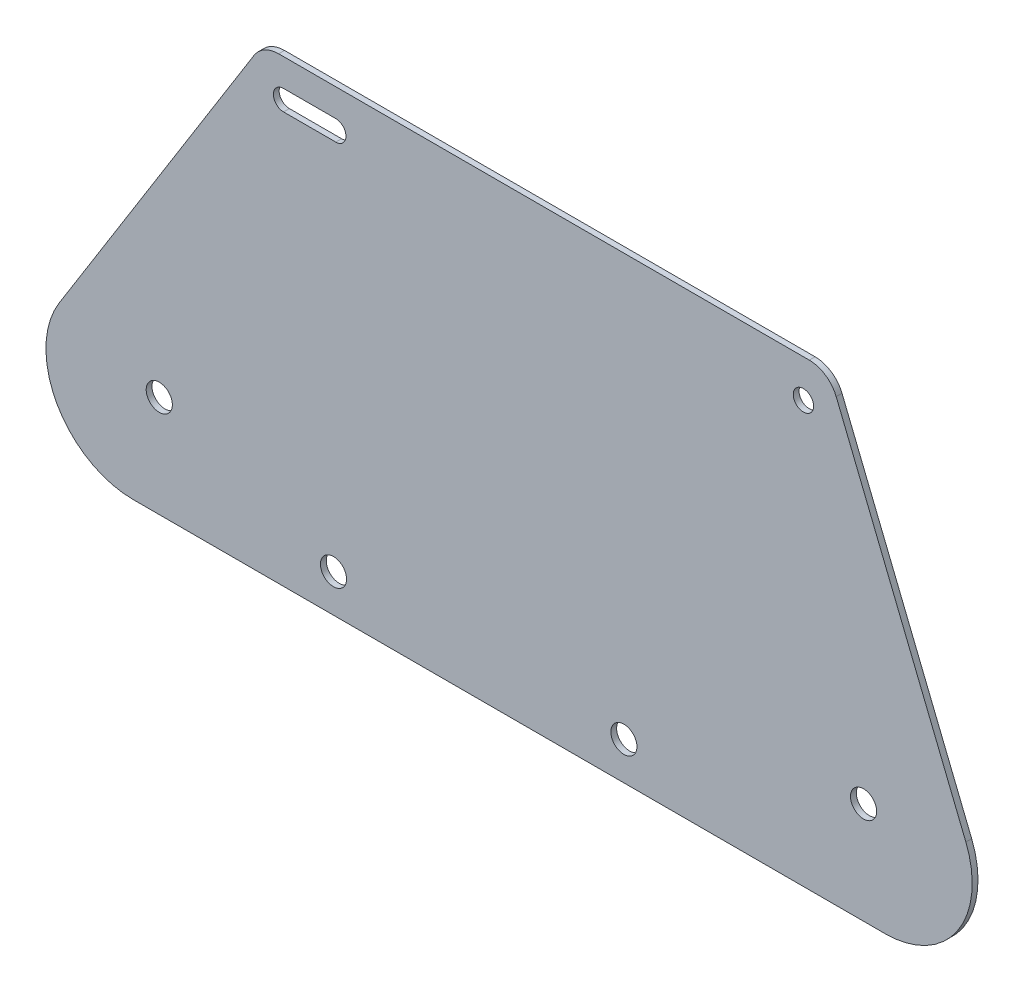
ISO-10303-21;
HEADER;
FILE_DESCRIPTION(('STEP AP214'),'2;1');
FILE_NAME('part.step','',(''),(''),'','','');
FILE_SCHEMA(('AUTOMOTIVE_DESIGN { 1 0 10303 214 1 1 1 1 }'));
ENDSEC;
DATA;
#1=APPLICATION_CONTEXT('core data for automotive mechanical design processes');
#2=APPLICATION_PROTOCOL_DEFINITION('international standard','automotive_design',2000,#1);
#3=PRODUCT_CONTEXT('',#1,'mechanical');
#4=PRODUCT('Part','Part','',(#3));
#5=PRODUCT_RELATED_PRODUCT_CATEGORY('part','',(#4));
#6=PRODUCT_DEFINITION_FORMATION('','',#4);
#7=PRODUCT_DEFINITION_CONTEXT('part definition',#1,'design');
#8=PRODUCT_DEFINITION('design','',#6,#7);
#9=PRODUCT_DEFINITION_SHAPE('','',#8);
#10=(LENGTH_UNIT() NAMED_UNIT(*) SI_UNIT(.MILLI.,.METRE.));
#11=(NAMED_UNIT(*) PLANE_ANGLE_UNIT() SI_UNIT($,.RADIAN.));
#12=(NAMED_UNIT(*) SI_UNIT($,.STERADIAN.) SOLID_ANGLE_UNIT());
#13=UNCERTAINTY_MEASURE_WITH_UNIT(LENGTH_MEASURE(1.E-05),#10,'distance_accuracy_value','');
#14=(GEOMETRIC_REPRESENTATION_CONTEXT(3) GLOBAL_UNCERTAINTY_ASSIGNED_CONTEXT((#13)) GLOBAL_UNIT_ASSIGNED_CONTEXT((#10,
#11,#12)) REPRESENTATION_CONTEXT('',''));
#15=CARTESIAN_POINT('',(0.,0.,0.));
#16=DIRECTION('',(0.,0.,1.));
#17=DIRECTION('',(1.,0.,0.));
#18=AXIS2_PLACEMENT_3D('',#15,#16,#17);
#19=CARTESIAN_POINT('',(0.,0.,2.));
#20=DIRECTION('',(0.,0.,1.));
#21=DIRECTION('',(1.,0.,0.));
#22=AXIS2_PLACEMENT_3D('',#19,#20,#21);
#23=PLANE('',#22);
#24=CARTESIAN_POINT('',(123.1416714345,13.,2.));
#25=DIRECTION('',(0.,0.,1.));
#26=DIRECTION('',(1.,0.,0.));
#27=AXIS2_PLACEMENT_3D('',#24,#25,#26);
#28=CIRCLE('',#27,4.49999999999999);
#29=CARTESIAN_POINT('',(127.6416714345,13.,2.));
#30=VERTEX_POINT('',#29);
#31=EDGE_CURVE('E445',#30,#30,#28,.T.);
#32=ORIENTED_EDGE('',*,*,#31,.F.);
#33=EDGE_LOOP('',(#32));
#34=FACE_BOUND('',#33,.T.);
#35=CARTESIAN_POINT('',(305.675867385683,35.,2.));
#36=DIRECTION('',(0.,0.,1.));
#37=DIRECTION('',(1.,0.,0.));
#38=AXIS2_PLACEMENT_3D('',#35,#36,#37);
#39=CIRCLE('',#38,4.50000000000002);
#40=CARTESIAN_POINT('',(310.175867385683,35.,2.));
#41=VERTEX_POINT('',#40);
#42=EDGE_CURVE('E453',#41,#41,#39,.T.);
#43=ORIENTED_EDGE('',*,*,#42,.F.);
#44=EDGE_LOOP('',(#43));
#45=FACE_BOUND('',#44,.T.);
#46=DIRECTION('',(1.,0.,0.));
#47=VECTOR('',#46,1.);
#48=CARTESIAN_POINT('',(105.935375270559,141.5,2.));
#49=LINE('',#48,#47);
#50=CARTESIAN_POINT('',(105.935375270559,141.5,2.));
#51=VERTEX_POINT('',#50);
#52=CARTESIAN_POINT('',(123.935375270559,141.5,2.));
#53=VERTEX_POINT('',#52);
#54=EDGE_CURVE('E135',#51,#53,#49,.T.);
#55=ORIENTED_EDGE('',*,*,#54,.F.);
#56=CARTESIAN_POINT('',(105.935375270559,145.,2.));
#57=DIRECTION('',(0.,0.,1.));
#58=DIRECTION('',(1.,0.,0.));
#59=AXIS2_PLACEMENT_3D('',#56,#57,#58);
#60=CIRCLE('',#59,3.49999999999998);
#61=CARTESIAN_POINT('',(105.935375270559,148.5,2.));
#62=VERTEX_POINT('',#61);
#63=EDGE_CURVE('E125',#62,#51,#60,.T.);
#64=ORIENTED_EDGE('',*,*,#63,.F.);
#65=DIRECTION('',(-1.,0.,0.));
#66=VECTOR('',#65,1.);
#67=CARTESIAN_POINT('',(105.935375270559,148.5,2.));
#68=LINE('',#67,#66);
#69=CARTESIAN_POINT('',(123.935375270559,148.5,2.));
#70=VERTEX_POINT('',#69);
#71=EDGE_CURVE('E150',#70,#62,#68,.T.);
#72=ORIENTED_EDGE('',*,*,#71,.F.);
#73=CARTESIAN_POINT('',(123.935375270559,145.,2.));
#74=DIRECTION('',(0.,0.,1.));
#75=DIRECTION('',(1.,0.,0.));
#76=AXIS2_PLACEMENT_3D('',#73,#74,#75);
#77=CIRCLE('',#76,3.49999999999998);
#78=EDGE_CURVE('E148',#53,#70,#77,.T.);
#79=ORIENTED_EDGE('',*,*,#78,.F.);
#80=EDGE_LOOP('',(#55,#64,#72,#79));
#81=FACE_BOUND('',#80,.T.);
#82=DIRECTION('',(-0.374606593415916,0.927183854566786,0.));
#83=VECTOR('',#82,1.);
#84=CARTESIAN_POINT('',(357.565501283629,0.,2.));
#85=LINE('',#84,#83);
#86=CARTESIAN_POINT('',(340.90418786525,41.2381978024775,2.));
#87=VERTEX_POINT('',#86);
#88=CARTESIAN_POINT('',(296.256110978917,151.746065934159,2.));
#89=VERTEX_POINT('',#88);
#90=EDGE_CURVE('E171',#87,#89,#85,.T.);
#91=ORIENTED_EDGE('',*,*,#90,.T.);
#92=CARTESIAN_POINT('',(286.984272433249,148.,2.));
#93=DIRECTION('',(0.,0.,1.));
#94=DIRECTION('',(1.,0.,0.));
#95=AXIS2_PLACEMENT_3D('',#92,#93,#94);
#96=CIRCLE('',#95,10.);
#97=CARTESIAN_POINT('',(286.984272433249,158.,2.));
#98=VERTEX_POINT('',#97);
#99=EDGE_CURVE('E40',#89,#98,#96,.T.);
#100=ORIENTED_EDGE('',*,*,#99,.T.);
#101=DIRECTION('',(-1.,0.,0.));
#102=VECTOR('',#101,1.);
#103=CARTESIAN_POINT('',(98.7293576016731,158.,2.));
#104=LINE('',#103,#102);
#105=CARTESIAN_POINT('',(104.272448116201,158.,2.));
#106=VERTEX_POINT('',#105);
#107=EDGE_CURVE('E174',#98,#106,#104,.T.);
#108=ORIENTED_EDGE('',*,*,#107,.T.);
#109=CARTESIAN_POINT('',(104.272448116201,148.,2.));
#110=DIRECTION('',(0.,0.,1.));
#111=DIRECTION('',(1.,0.,0.));
#112=AXIS2_PLACEMENT_3D('',#109,#110,#111);
#113=CIRCLE('',#112,10.);
#114=CARTESIAN_POINT('',(95.7919671546366,153.299192642332,2.));
#115=VERTEX_POINT('',#114);
#116=EDGE_CURVE('E47',#106,#115,#113,.T.);
#117=ORIENTED_EDGE('',*,*,#116,.T.);
#118=DIRECTION('',(-0.529919264233203,-0.848048096156428,0.));
#119=VECTOR('',#118,1.);
#120=CARTESIAN_POINT('',(0.,0.,2.));
#121=LINE('',#120,#119);
#122=CARTESIAN_POINT('',(28.6799897734497,45.8975779269961,2.));
#123=VERTEX_POINT('',#122);
#124=EDGE_CURVE('E176',#115,#123,#121,.T.);
#125=ORIENTED_EDGE('',*,*,#124,.T.);
#126=CARTESIAN_POINT('',(54.1214326581425,30.,2.));
#127=DIRECTION('',(0.,0.,1.));
#128=DIRECTION('',(1.,0.,0.));
#129=AXIS2_PLACEMENT_3D('',#126,#127,#128);
#130=CIRCLE('',#129,30.);
#131=CARTESIAN_POINT('',(54.1214326581425,0.,2.));
#132=VERTEX_POINT('',#131);
#133=EDGE_CURVE('E199',#123,#132,#130,.T.);
#134=ORIENTED_EDGE('',*,*,#133,.T.);
#135=DIRECTION('',(1.,0.,0.));
#136=VECTOR('',#135,1.);
#137=CARTESIAN_POINT('',(0.,0.,2.));
#138=LINE('',#137,#136);
#139=CARTESIAN_POINT('',(313.088672228246,0.,2.));
#140=VERTEX_POINT('',#139);
#141=EDGE_CURVE('E168',#132,#140,#138,.T.);
#142=ORIENTED_EDGE('',*,*,#141,.T.);
#143=CARTESIAN_POINT('',(313.088672228246,30.,2.));
#144=DIRECTION('',(0.,0.,1.));
#145=DIRECTION('',(1.,0.,0.));
#146=AXIS2_PLACEMENT_3D('',#143,#144,#145);
#147=CIRCLE('',#146,30.);
#148=EDGE_CURVE('E201',#140,#87,#147,.T.);
#149=ORIENTED_EDGE('',*,*,#148,.T.);
#150=EDGE_LOOP('',(#91,#100,#108,#117,#125,#134,#142,#149));
#151=FACE_BOUND('',#150,.T.);
#152=CARTESIAN_POINT('',(284.960746882722,145.,2.));
#153=DIRECTION('',(0.,0.,1.));
#154=DIRECTION('',(1.,0.,0.));
#155=AXIS2_PLACEMENT_3D('',#152,#153,#154);
#156=CIRCLE('',#155,3.50000000000002);
#157=CARTESIAN_POINT('',(288.460746882722,145.,2.));
#158=VERTEX_POINT('',#157);
#159=EDGE_CURVE('E157',#158,#158,#156,.T.);
#160=ORIENTED_EDGE('',*,*,#159,.F.);
#161=EDGE_LOOP('',(#160));
#162=FACE_BOUND('',#161,.T.);
#163=CARTESIAN_POINT('',(63.1416714344996,35.,2.));
#164=DIRECTION('',(0.,0.,1.));
#165=DIRECTION('',(1.,0.,0.));
#166=AXIS2_PLACEMENT_3D('',#163,#164,#165);
#167=CIRCLE('',#166,4.50000000000001);
#168=CARTESIAN_POINT('',(67.6416714344996,35.,2.));
#169=VERTEX_POINT('',#168);
#170=EDGE_CURVE('E449',#169,#169,#167,.T.);
#171=ORIENTED_EDGE('',*,*,#170,.F.);
#172=EDGE_LOOP('',(#171));
#173=FACE_BOUND('',#172,.T.);
#174=CARTESIAN_POINT('',(223.1416714345,13.,2.));
#175=DIRECTION('',(0.,0.,1.));
#176=DIRECTION('',(1.,0.,0.));
#177=AXIS2_PLACEMENT_3D('',#174,#175,#176);
#178=CIRCLE('',#177,4.49999999999999);
#179=CARTESIAN_POINT('',(227.6416714345,13.,2.));
#180=VERTEX_POINT('',#179);
#181=EDGE_CURVE('E440',#180,#180,#178,.T.);
#182=ORIENTED_EDGE('',*,*,#181,.F.);
#183=EDGE_LOOP('',(#182));
#184=FACE_BOUND('',#183,.T.);
#185=ADVANCED_FACE('F32',(#34,#45,#81,#151,#162,#173,#184),#23,.T.);
#186=CARTESIAN_POINT('',(0.,0.,0.));
#187=DIRECTION('',(0.,0.,1.));
#188=DIRECTION('',(1.,0.,0.));
#189=AXIS2_PLACEMENT_3D('',#186,#187,#188);
#190=PLANE('',#189);
#191=DIRECTION('',(-1.,0.,0.));
#192=VECTOR('',#191,1.);
#193=CARTESIAN_POINT('',(98.7293576016731,158.,0.));
#194=LINE('',#193,#192);
#195=CARTESIAN_POINT('',(286.984272433249,158.,0.));
#196=VERTEX_POINT('',#195);
#197=CARTESIAN_POINT('',(104.272448116201,158.,0.));
#198=VERTEX_POINT('',#197);
#199=EDGE_CURVE('E183',#196,#198,#194,.T.);
#200=ORIENTED_EDGE('',*,*,#199,.F.);
#201=CARTESIAN_POINT('',(286.984272433249,148.,0.));
#202=DIRECTION('',(0.,0.,1.));
#203=DIRECTION('',(1.,0.,0.));
#204=AXIS2_PLACEMENT_3D('',#201,#202,#203);
#205=CIRCLE('',#204,10.);
#206=CARTESIAN_POINT('',(296.256110978917,151.746065934159,0.));
#207=VERTEX_POINT('',#206);
#208=EDGE_CURVE('E213',#196,#207,#205,.F.);
#209=ORIENTED_EDGE('',*,*,#208,.T.);
#210=DIRECTION('',(-0.374606593415916,0.927183854566786,0.));
#211=VECTOR('',#210,1.);
#212=CARTESIAN_POINT('',(357.565501283629,0.,0.));
#213=LINE('',#212,#211);
#214=CARTESIAN_POINT('',(340.90418786525,41.2381978024775,0.));
#215=VERTEX_POINT('',#214);
#216=EDGE_CURVE('E181',#215,#207,#213,.T.);
#217=ORIENTED_EDGE('',*,*,#216,.F.);
#218=CARTESIAN_POINT('',(313.088672228246,30.,0.));
#219=DIRECTION('',(0.,0.,1.));
#220=DIRECTION('',(1.,0.,0.));
#221=AXIS2_PLACEMENT_3D('',#218,#219,#220);
#222=CIRCLE('',#221,30.);
#223=CARTESIAN_POINT('',(313.088672228246,0.,0.));
#224=VERTEX_POINT('',#223);
#225=EDGE_CURVE('E192',#215,#224,#222,.F.);
#226=ORIENTED_EDGE('',*,*,#225,.T.);
#227=DIRECTION('',(1.,0.,0.));
#228=VECTOR('',#227,1.);
#229=CARTESIAN_POINT('',(0.,0.,0.));
#230=LINE('',#229,#228);
#231=CARTESIAN_POINT('',(54.1214326581425,0.,0.));
#232=VERTEX_POINT('',#231);
#233=EDGE_CURVE('E143',#232,#224,#230,.T.);
#234=ORIENTED_EDGE('',*,*,#233,.F.);
#235=CARTESIAN_POINT('',(54.1214326581425,30.,0.));
#236=DIRECTION('',(0.,0.,1.));
#237=DIRECTION('',(1.,0.,0.));
#238=AXIS2_PLACEMENT_3D('',#235,#236,#237);
#239=CIRCLE('',#238,30.);
#240=CARTESIAN_POINT('',(28.6799897734497,45.8975779269961,0.));
#241=VERTEX_POINT('',#240);
#242=EDGE_CURVE('E189',#232,#241,#239,.F.);
#243=ORIENTED_EDGE('',*,*,#242,.T.);
#244=DIRECTION('',(-0.529919264233203,-0.848048096156428,0.));
#245=VECTOR('',#244,1.);
#246=CARTESIAN_POINT('',(0.,0.,0.));
#247=LINE('',#246,#245);
#248=CARTESIAN_POINT('',(95.7919671546366,153.299192642332,0.));
#249=VERTEX_POINT('',#248);
#250=EDGE_CURVE('E172',#249,#241,#247,.T.);
#251=ORIENTED_EDGE('',*,*,#250,.F.);
#252=CARTESIAN_POINT('',(104.272448116201,148.,0.));
#253=DIRECTION('',(0.,0.,1.));
#254=DIRECTION('',(1.,0.,0.));
#255=AXIS2_PLACEMENT_3D('',#252,#253,#254);
#256=CIRCLE('',#255,10.);
#257=EDGE_CURVE('E211',#249,#198,#256,.F.);
#258=ORIENTED_EDGE('',*,*,#257,.T.);
#259=EDGE_LOOP('',(#200,#209,#217,#226,#234,#243,#251,#258));
#260=FACE_BOUND('',#259,.T.);
#261=CARTESIAN_POINT('',(105.935375270559,145.,0.));
#262=DIRECTION('',(0.,0.,1.));
#263=DIRECTION('',(1.,0.,0.));
#264=AXIS2_PLACEMENT_3D('',#261,#262,#263);
#265=CIRCLE('',#264,3.49999999999998);
#266=CARTESIAN_POINT('',(105.935375270559,148.5,0.));
#267=VERTEX_POINT('',#266);
#268=CARTESIAN_POINT('',(105.935375270559,141.5,0.));
#269=VERTEX_POINT('',#268);
#270=EDGE_CURVE('E155',#267,#269,#265,.T.);
#271=ORIENTED_EDGE('',*,*,#270,.T.);
#272=DIRECTION('',(1.,0.,0.));
#273=VECTOR('',#272,1.);
#274=CARTESIAN_POINT('',(105.935375270559,141.5,0.));
#275=LINE('',#274,#273);
#276=CARTESIAN_POINT('',(123.935375270559,141.5,0.));
#277=VERTEX_POINT('',#276);
#278=EDGE_CURVE('E142',#269,#277,#275,.T.);
#279=ORIENTED_EDGE('',*,*,#278,.T.);
#280=CARTESIAN_POINT('',(123.935375270559,145.,0.));
#281=DIRECTION('',(0.,0.,1.));
#282=DIRECTION('',(1.,0.,0.));
#283=AXIS2_PLACEMENT_3D('',#280,#281,#282);
#284=CIRCLE('',#283,3.49999999999998);
#285=CARTESIAN_POINT('',(123.935375270559,148.5,0.));
#286=VERTEX_POINT('',#285);
#287=EDGE_CURVE('E159',#277,#286,#284,.T.);
#288=ORIENTED_EDGE('',*,*,#287,.T.);
#289=DIRECTION('',(-1.,0.,0.));
#290=VECTOR('',#289,1.);
#291=CARTESIAN_POINT('',(105.935375270559,148.5,0.));
#292=LINE('',#291,#290);
#293=EDGE_CURVE('E136',#286,#267,#292,.T.);
#294=ORIENTED_EDGE('',*,*,#293,.T.);
#295=EDGE_LOOP('',(#271,#279,#288,#294));
#296=FACE_BOUND('',#295,.T.);
#297=CARTESIAN_POINT('',(284.960746882722,145.,0.));
#298=DIRECTION('',(0.,0.,1.));
#299=DIRECTION('',(1.,0.,0.));
#300=AXIS2_PLACEMENT_3D('',#297,#298,#299);
#301=CIRCLE('',#300,3.50000000000002);
#302=CARTESIAN_POINT('',(288.460746882722,145.,0.));
#303=VERTEX_POINT('',#302);
#304=EDGE_CURVE('E423',#303,#303,#301,.T.);
#305=ORIENTED_EDGE('',*,*,#304,.T.);
#306=EDGE_LOOP('',(#305));
#307=FACE_BOUND('',#306,.T.);
#308=CARTESIAN_POINT('',(305.675867385683,35.,0.));
#309=DIRECTION('',(0.,0.,1.));
#310=DIRECTION('',(1.,0.,0.));
#311=AXIS2_PLACEMENT_3D('',#308,#309,#310);
#312=CIRCLE('',#311,4.50000000000002);
#313=CARTESIAN_POINT('',(310.175867385683,35.,0.));
#314=VERTEX_POINT('',#313);
#315=EDGE_CURVE('E427',#314,#314,#312,.T.);
#316=ORIENTED_EDGE('',*,*,#315,.T.);
#317=EDGE_LOOP('',(#316));
#318=FACE_BOUND('',#317,.T.);
#319=CARTESIAN_POINT('',(63.1416714344996,35.,0.));
#320=DIRECTION('',(0.,0.,1.));
#321=DIRECTION('',(1.,0.,0.));
#322=AXIS2_PLACEMENT_3D('',#319,#320,#321);
#323=CIRCLE('',#322,4.50000000000001);
#324=CARTESIAN_POINT('',(67.6416714344996,35.,0.));
#325=VERTEX_POINT('',#324);
#326=EDGE_CURVE('E431',#325,#325,#323,.T.);
#327=ORIENTED_EDGE('',*,*,#326,.T.);
#328=EDGE_LOOP('',(#327));
#329=FACE_BOUND('',#328,.T.);
#330=CARTESIAN_POINT('',(123.1416714345,13.,0.));
#331=DIRECTION('',(0.,0.,1.));
#332=DIRECTION('',(1.,0.,0.));
#333=AXIS2_PLACEMENT_3D('',#330,#331,#332);
#334=CIRCLE('',#333,4.49999999999999);
#335=CARTESIAN_POINT('',(127.6416714345,13.,0.));
#336=VERTEX_POINT('',#335);
#337=EDGE_CURVE('E435',#336,#336,#334,.T.);
#338=ORIENTED_EDGE('',*,*,#337,.T.);
#339=EDGE_LOOP('',(#338));
#340=FACE_BOUND('',#339,.T.);
#341=CARTESIAN_POINT('',(223.1416714345,13.,0.));
#342=DIRECTION('',(0.,0.,1.));
#343=DIRECTION('',(1.,0.,0.));
#344=AXIS2_PLACEMENT_3D('',#341,#342,#343);
#345=CIRCLE('',#344,4.49999999999999);
#346=CARTESIAN_POINT('',(227.6416714345,13.,0.));
#347=VERTEX_POINT('',#346);
#348=EDGE_CURVE('E438',#347,#347,#345,.T.);
#349=ORIENTED_EDGE('',*,*,#348,.T.);
#350=EDGE_LOOP('',(#349));
#351=FACE_BOUND('',#350,.T.);
#352=ADVANCED_FACE('F228',(#260,#296,#307,#318,#329,#340,#351),#190,.F.);
#353=CARTESIAN_POINT('',(0.,0.,2.));
#354=DIRECTION('',(0.,1.,0.));
#355=DIRECTION('',(0.,0.,1.));
#356=AXIS2_PLACEMENT_3D('',#353,#354,#355);
#357=PLANE('',#356);
#358=ORIENTED_EDGE('',*,*,#233,.T.);
#359=DIRECTION('',(0.,0.,-1.));
#360=VECTOR('',#359,1.);
#361=CARTESIAN_POINT('',(313.088672228246,0.,2.));
#362=LINE('',#361,#360);
#363=EDGE_CURVE('E197',#224,#140,#362,.F.);
#364=ORIENTED_EDGE('',*,*,#363,.T.);
#365=ORIENTED_EDGE('',*,*,#141,.F.);
#366=DIRECTION('',(0.,0.,-1.));
#367=VECTOR('',#366,1.);
#368=CARTESIAN_POINT('',(54.1214326581425,0.,2.));
#369=LINE('',#368,#367);
#370=EDGE_CURVE('E194',#132,#232,#369,.T.);
#371=ORIENTED_EDGE('',*,*,#370,.T.);
#372=EDGE_LOOP('',(#358,#364,#365,#371));
#373=FACE_BOUND('',#372,.T.);
#374=ADVANCED_FACE('F238',(#373),#357,.F.);
#375=CARTESIAN_POINT('',(357.565501283629,0.,2.));
#376=DIRECTION('',(-0.927183854566786,-0.374606593415916,0.));
#377=DIRECTION('',(0.374606593415916,-0.927183854566786,0.));
#378=AXIS2_PLACEMENT_3D('',#375,#376,#377);
#379=PLANE('',#378);
#380=ORIENTED_EDGE('',*,*,#216,.T.);
#381=DIRECTION('',(0.,0.,-1.));
#382=VECTOR('',#381,1.);
#383=CARTESIAN_POINT('',(296.256110978917,151.746065934159,2.));
#384=LINE('',#383,#382);
#385=EDGE_CURVE('E55',#207,#89,#384,.F.);
#386=ORIENTED_EDGE('',*,*,#385,.T.);
#387=ORIENTED_EDGE('',*,*,#90,.F.);
#388=DIRECTION('',(0.,0.,-1.));
#389=VECTOR('',#388,1.);
#390=CARTESIAN_POINT('',(340.90418786525,41.2381978024775,2.));
#391=LINE('',#390,#389);
#392=EDGE_CURVE('E178',#87,#215,#391,.T.);
#393=ORIENTED_EDGE('',*,*,#392,.T.);
#394=EDGE_LOOP('',(#380,#386,#387,#393));
#395=FACE_BOUND('',#394,.T.);
#396=ADVANCED_FACE('F230',(#395),#379,.F.);
#397=CARTESIAN_POINT('',(98.7293576016731,158.,2.));
#398=DIRECTION('',(0.,-1.,0.));
#399=DIRECTION('',(0.,0.,-1.));
#400=AXIS2_PLACEMENT_3D('',#397,#398,#399);
#401=PLANE('',#400);
#402=ORIENTED_EDGE('',*,*,#107,.F.);
#403=DIRECTION('',(0.,0.,-1.));
#404=VECTOR('',#403,1.);
#405=CARTESIAN_POINT('',(286.984272433249,158.,2.));
#406=LINE('',#405,#404);
#407=EDGE_CURVE('E208',#98,#196,#406,.T.);
#408=ORIENTED_EDGE('',*,*,#407,.T.);
#409=ORIENTED_EDGE('',*,*,#199,.T.);
#410=DIRECTION('',(0.,0.,-1.));
#411=VECTOR('',#410,1.);
#412=CARTESIAN_POINT('',(104.272448116201,158.,2.));
#413=LINE('',#412,#411);
#414=EDGE_CURVE('E206',#198,#106,#413,.F.);
#415=ORIENTED_EDGE('',*,*,#414,.T.);
#416=EDGE_LOOP('',(#402,#408,#409,#415));
#417=FACE_BOUND('',#416,.T.);
#418=ADVANCED_FACE('F222',(#417),#401,.F.);
#419=CARTESIAN_POINT('',(0.,0.,2.));
#420=DIRECTION('',(0.848048096156428,-0.529919264233203,0.));
#421=DIRECTION('',(0.529919264233203,0.848048096156428,0.));
#422=AXIS2_PLACEMENT_3D('',#419,#420,#421);
#423=PLANE('',#422);
#424=ORIENTED_EDGE('',*,*,#124,.F.);
#425=DIRECTION('',(0.,0.,-1.));
#426=VECTOR('',#425,1.);
#427=CARTESIAN_POINT('',(95.7919671546366,153.299192642332,2.));
#428=LINE('',#427,#426);
#429=EDGE_CURVE('E11',#115,#249,#428,.T.);
#430=ORIENTED_EDGE('',*,*,#429,.T.);
#431=ORIENTED_EDGE('',*,*,#250,.T.);
#432=DIRECTION('',(0.,0.,-1.));
#433=VECTOR('',#432,1.);
#434=CARTESIAN_POINT('',(28.6799897734497,45.8975779269961,2.));
#435=LINE('',#434,#433);
#436=EDGE_CURVE('E203',#241,#123,#435,.F.);
#437=ORIENTED_EDGE('',*,*,#436,.T.);
#438=EDGE_LOOP('',(#424,#430,#431,#437));
#439=FACE_BOUND('',#438,.T.);
#440=ADVANCED_FACE('F247',(#439),#423,.F.);
#441=CARTESIAN_POINT('',(105.935375270559,145.,2.));
#442=DIRECTION('',(0.,0.,-1.));
#443=DIRECTION('',(-1.,0.,0.));
#444=AXIS2_PLACEMENT_3D('',#441,#442,#443);
#445=CYLINDRICAL_SURFACE('',#444,3.49999999999998);
#446=ORIENTED_EDGE('',*,*,#270,.F.);
#447=DIRECTION('',(0.,0.,-1.));
#448=VECTOR('',#447,1.);
#449=CARTESIAN_POINT('',(105.935375270559,148.5,2.));
#450=LINE('',#449,#448);
#451=EDGE_CURVE('E131',#62,#267,#450,.T.);
#452=ORIENTED_EDGE('',*,*,#451,.F.);
#453=ORIENTED_EDGE('',*,*,#63,.T.);
#454=DIRECTION('',(0.,0.,-1.));
#455=VECTOR('',#454,1.);
#456=CARTESIAN_POINT('',(105.935375270559,141.5,2.));
#457=LINE('',#456,#455);
#458=EDGE_CURVE('E128',#51,#269,#457,.T.);
#459=ORIENTED_EDGE('',*,*,#458,.T.);
#460=EDGE_LOOP('',(#446,#452,#453,#459));
#461=FACE_BOUND('',#460,.T.);
#462=ADVANCED_FACE('F127',(#461),#445,.F.);
#463=CARTESIAN_POINT('',(105.935375270559,141.5,2.));
#464=DIRECTION('',(0.,1.,0.));
#465=DIRECTION('',(0.,0.,1.));
#466=AXIS2_PLACEMENT_3D('',#463,#464,#465);
#467=PLANE('',#466);
#468=ORIENTED_EDGE('',*,*,#278,.F.);
#469=ORIENTED_EDGE('',*,*,#458,.F.);
#470=ORIENTED_EDGE('',*,*,#54,.T.);
#471=DIRECTION('',(0.,0.,-1.));
#472=VECTOR('',#471,1.);
#473=CARTESIAN_POINT('',(123.935375270559,141.5,2.));
#474=LINE('',#473,#472);
#475=EDGE_CURVE('E144',#53,#277,#474,.T.);
#476=ORIENTED_EDGE('',*,*,#475,.T.);
#477=EDGE_LOOP('',(#468,#469,#470,#476));
#478=FACE_BOUND('',#477,.T.);
#479=ADVANCED_FACE('F139',(#478),#467,.T.);
#480=CARTESIAN_POINT('',(123.935375270559,145.,2.));
#481=DIRECTION('',(0.,0.,-1.));
#482=DIRECTION('',(-1.,0.,0.));
#483=AXIS2_PLACEMENT_3D('',#480,#481,#482);
#484=CYLINDRICAL_SURFACE('',#483,3.49999999999998);
#485=ORIENTED_EDGE('',*,*,#287,.F.);
#486=ORIENTED_EDGE('',*,*,#475,.F.);
#487=ORIENTED_EDGE('',*,*,#78,.T.);
#488=DIRECTION('',(0.,0.,-1.));
#489=VECTOR('',#488,1.);
#490=CARTESIAN_POINT('',(123.935375270559,148.5,2.));
#491=LINE('',#490,#489);
#492=EDGE_CURVE('E165',#70,#286,#491,.T.);
#493=ORIENTED_EDGE('',*,*,#492,.T.);
#494=EDGE_LOOP('',(#485,#486,#487,#493));
#495=FACE_BOUND('',#494,.T.);
#496=ADVANCED_FACE('F387',(#495),#484,.F.);
#497=CARTESIAN_POINT('',(105.935375270559,148.5,2.));
#498=DIRECTION('',(0.,-1.,0.));
#499=DIRECTION('',(0.,0.,-1.));
#500=AXIS2_PLACEMENT_3D('',#497,#498,#499);
#501=PLANE('',#500);
#502=ORIENTED_EDGE('',*,*,#293,.F.);
#503=ORIENTED_EDGE('',*,*,#492,.F.);
#504=ORIENTED_EDGE('',*,*,#71,.T.);
#505=ORIENTED_EDGE('',*,*,#451,.T.);
#506=EDGE_LOOP('',(#502,#503,#504,#505));
#507=FACE_BOUND('',#506,.T.);
#508=ADVANCED_FACE('F378',(#507),#501,.T.);
#509=CARTESIAN_POINT('',(284.960746882722,145.,2.));
#510=DIRECTION('',(0.,0.,-1.));
#511=DIRECTION('',(-1.,0.,0.));
#512=AXIS2_PLACEMENT_3D('',#509,#510,#511);
#513=CYLINDRICAL_SURFACE('',#512,3.50000000000002);
#514=ORIENTED_EDGE('',*,*,#159,.T.);
#515=EDGE_LOOP('',(#514));
#516=FACE_BOUND('',#515,.T.);
#517=ORIENTED_EDGE('',*,*,#304,.F.);
#518=EDGE_LOOP('',(#517));
#519=FACE_BOUND('',#518,.T.);
#520=ADVANCED_FACE('F369',(#516,#519),#513,.F.);
#521=CARTESIAN_POINT('',(305.675867385683,35.,2.));
#522=DIRECTION('',(0.,0.,-1.));
#523=DIRECTION('',(-1.,0.,0.));
#524=AXIS2_PLACEMENT_3D('',#521,#522,#523);
#525=CYLINDRICAL_SURFACE('',#524,4.50000000000002);
#526=ORIENTED_EDGE('',*,*,#42,.T.);
#527=EDGE_LOOP('',(#526));
#528=FACE_BOUND('',#527,.T.);
#529=ORIENTED_EDGE('',*,*,#315,.F.);
#530=EDGE_LOOP('',(#529));
#531=FACE_BOUND('',#530,.T.);
#532=ADVANCED_FACE('F360',(#528,#531),#525,.F.);
#533=CARTESIAN_POINT('',(63.1416714344996,35.,2.));
#534=DIRECTION('',(0.,0.,-1.));
#535=DIRECTION('',(-1.,0.,0.));
#536=AXIS2_PLACEMENT_3D('',#533,#534,#535);
#537=CYLINDRICAL_SURFACE('',#536,4.50000000000001);
#538=ORIENTED_EDGE('',*,*,#170,.T.);
#539=EDGE_LOOP('',(#538));
#540=FACE_BOUND('',#539,.T.);
#541=ORIENTED_EDGE('',*,*,#326,.F.);
#542=EDGE_LOOP('',(#541));
#543=FACE_BOUND('',#542,.T.);
#544=ADVANCED_FACE('F351',(#540,#543),#537,.F.);
#545=CARTESIAN_POINT('',(123.1416714345,13.,2.));
#546=DIRECTION('',(0.,0.,-1.));
#547=DIRECTION('',(-1.,0.,0.));
#548=AXIS2_PLACEMENT_3D('',#545,#546,#547);
#549=CYLINDRICAL_SURFACE('',#548,4.49999999999999);
#550=ORIENTED_EDGE('',*,*,#31,.T.);
#551=EDGE_LOOP('',(#550));
#552=FACE_BOUND('',#551,.T.);
#553=ORIENTED_EDGE('',*,*,#337,.F.);
#554=EDGE_LOOP('',(#553));
#555=FACE_BOUND('',#554,.T.);
#556=ADVANCED_FACE('F344',(#552,#555),#549,.F.);
#557=CARTESIAN_POINT('',(223.1416714345,13.,2.));
#558=DIRECTION('',(0.,0.,-1.));
#559=DIRECTION('',(-1.,0.,0.));
#560=AXIS2_PLACEMENT_3D('',#557,#558,#559);
#561=CYLINDRICAL_SURFACE('',#560,4.49999999999999);
#562=ORIENTED_EDGE('',*,*,#181,.T.);
#563=EDGE_LOOP('',(#562));
#564=FACE_BOUND('',#563,.T.);
#565=ORIENTED_EDGE('',*,*,#348,.F.);
#566=EDGE_LOOP('',(#565));
#567=FACE_BOUND('',#566,.T.);
#568=ADVANCED_FACE('F276',(#564,#567),#561,.F.);
#569=CARTESIAN_POINT('',(313.088672228246,30.,2.));
#570=DIRECTION('',(0.,0.,-1.));
#571=DIRECTION('',(-1.,0.,0.));
#572=AXIS2_PLACEMENT_3D('',#569,#570,#571);
#573=CYLINDRICAL_SURFACE('',#572,30.);
#574=ORIENTED_EDGE('',*,*,#148,.F.);
#575=ORIENTED_EDGE('',*,*,#363,.F.);
#576=ORIENTED_EDGE('',*,*,#225,.F.);
#577=ORIENTED_EDGE('',*,*,#392,.F.);
#578=EDGE_LOOP('',(#574,#575,#576,#577));
#579=FACE_BOUND('',#578,.T.);
#580=ADVANCED_FACE('F234',(#579),#573,.T.);
#581=CARTESIAN_POINT('',(54.1214326581425,30.,2.));
#582=DIRECTION('',(0.,0.,-1.));
#583=DIRECTION('',(-1.,0.,0.));
#584=AXIS2_PLACEMENT_3D('',#581,#582,#583);
#585=CYLINDRICAL_SURFACE('',#584,30.);
#586=ORIENTED_EDGE('',*,*,#133,.F.);
#587=ORIENTED_EDGE('',*,*,#436,.F.);
#588=ORIENTED_EDGE('',*,*,#242,.F.);
#589=ORIENTED_EDGE('',*,*,#370,.F.);
#590=EDGE_LOOP('',(#586,#587,#588,#589));
#591=FACE_BOUND('',#590,.T.);
#592=ADVANCED_FACE('F243',(#591),#585,.T.);
#593=CARTESIAN_POINT('',(286.984272433249,148.,2.));
#594=DIRECTION('',(0.,0.,-1.));
#595=DIRECTION('',(-1.,0.,0.));
#596=AXIS2_PLACEMENT_3D('',#593,#594,#595);
#597=CYLINDRICAL_SURFACE('',#596,10.);
#598=ORIENTED_EDGE('',*,*,#99,.F.);
#599=ORIENTED_EDGE('',*,*,#385,.F.);
#600=ORIENTED_EDGE('',*,*,#208,.F.);
#601=ORIENTED_EDGE('',*,*,#407,.F.);
#602=EDGE_LOOP('',(#598,#599,#600,#601));
#603=FACE_BOUND('',#602,.T.);
#604=ADVANCED_FACE('F225',(#603),#597,.T.);
#605=CARTESIAN_POINT('',(104.272448116201,148.,2.));
#606=DIRECTION('',(0.,0.,-1.));
#607=DIRECTION('',(-1.,0.,0.));
#608=AXIS2_PLACEMENT_3D('',#605,#606,#607);
#609=CYLINDRICAL_SURFACE('',#608,10.);
#610=ORIENTED_EDGE('',*,*,#116,.F.);
#611=ORIENTED_EDGE('',*,*,#414,.F.);
#612=ORIENTED_EDGE('',*,*,#257,.F.);
#613=ORIENTED_EDGE('',*,*,#429,.F.);
#614=EDGE_LOOP('',(#610,#611,#612,#613));
#615=FACE_BOUND('',#614,.T.);
#616=ADVANCED_FACE('F34',(#615),#609,.T.);
#617=CLOSED_SHELL('',(#185,#352,#374,#396,#418,#440,#462,#479,#496,#508,#520,#532,#544,#556,
#568,#580,#592,#604,#616));
#618=MANIFOLD_SOLID_BREP('B2',#617);
#619=ADVANCED_BREP_SHAPE_REPRESENTATION('',(#18,#618),#14);
#620=SHAPE_DEFINITION_REPRESENTATION(#9,#619);
ENDSEC;
END-ISO-10303-21;
